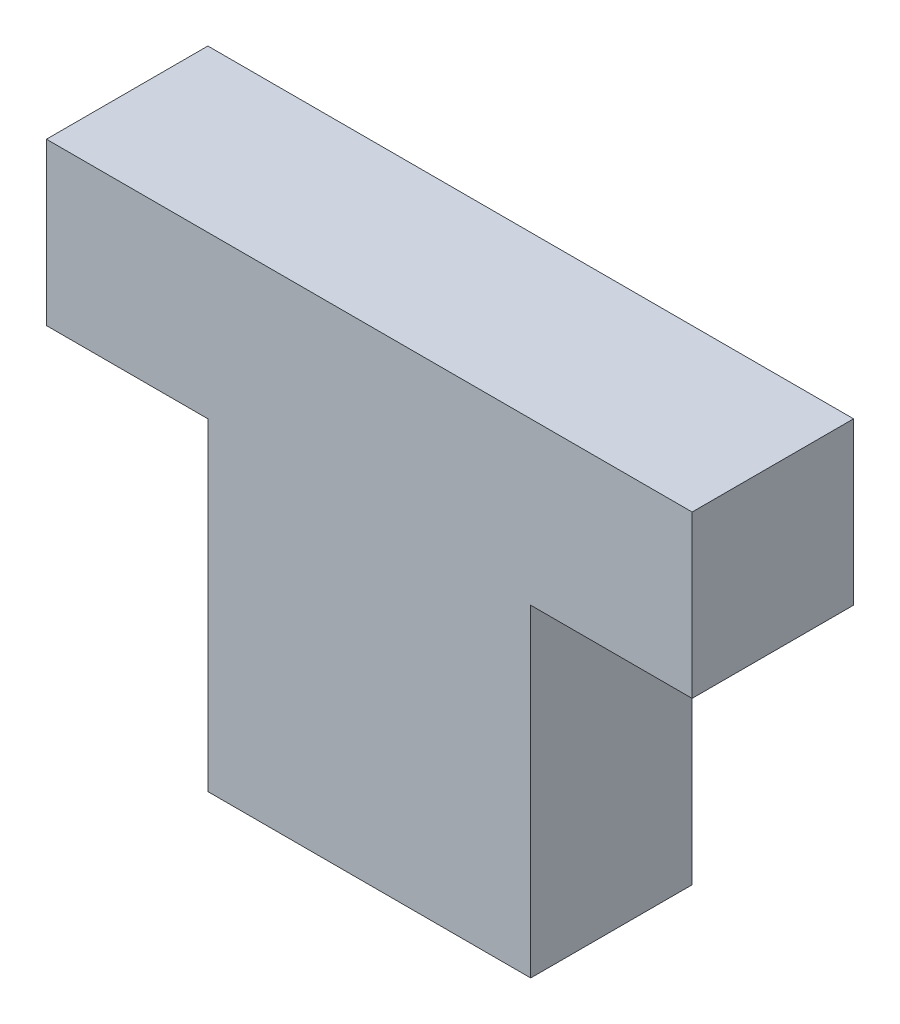
ISO-10303-21;
HEADER;
FILE_DESCRIPTION(('STEP AP214'),'2;1');
FILE_NAME('part.step','',(''),(''),'','','');
FILE_SCHEMA(('AUTOMOTIVE_DESIGN { 1 0 10303 214 1 1 1 1 }'));
ENDSEC;
DATA;
#1=APPLICATION_CONTEXT('core data for automotive mechanical design processes');
#2=APPLICATION_PROTOCOL_DEFINITION('international standard','automotive_design',2000,#1);
#3=PRODUCT_CONTEXT('',#1,'mechanical');
#4=PRODUCT('Part','Part','',(#3));
#5=PRODUCT_RELATED_PRODUCT_CATEGORY('part','',(#4));
#6=PRODUCT_DEFINITION_FORMATION('','',#4);
#7=PRODUCT_DEFINITION_CONTEXT('part definition',#1,'design');
#8=PRODUCT_DEFINITION('design','',#6,#7);
#9=PRODUCT_DEFINITION_SHAPE('','',#8);
#10=(LENGTH_UNIT() NAMED_UNIT(*) SI_UNIT(.MILLI.,.METRE.));
#11=(NAMED_UNIT(*) PLANE_ANGLE_UNIT() SI_UNIT($,.RADIAN.));
#12=(NAMED_UNIT(*) SI_UNIT($,.STERADIAN.) SOLID_ANGLE_UNIT());
#13=UNCERTAINTY_MEASURE_WITH_UNIT(LENGTH_MEASURE(1.E-05),#10,'distance_accuracy_value','');
#14=(GEOMETRIC_REPRESENTATION_CONTEXT(3) GLOBAL_UNCERTAINTY_ASSIGNED_CONTEXT((#13)) GLOBAL_UNIT_ASSIGNED_CONTEXT((#10,
#11,#12)) REPRESENTATION_CONTEXT('',''));
#15=CARTESIAN_POINT('',(0.,0.,0.));
#16=DIRECTION('',(0.,0.,1.));
#17=DIRECTION('',(1.,0.,0.));
#18=AXIS2_PLACEMENT_3D('',#15,#16,#17);
#19=CARTESIAN_POINT('',(4.99999999999999,0.,5.));
#20=DIRECTION('',(-1.,0.,0.));
#21=DIRECTION('',(0.,-1.,0.));
#22=AXIS2_PLACEMENT_3D('',#19,#20,#21);
#23=PLANE('',#22);
#24=DIRECTION('',(0.,1.,0.));
#25=VECTOR('',#24,1.);
#26=CARTESIAN_POINT('',(4.99999999999999,0.,0.));
#27=LINE('',#26,#25);
#28=CARTESIAN_POINT('',(5.,10.,0.));
#29=VERTEX_POINT('',#28);
#30=CARTESIAN_POINT('',(5.,15.,0.));
#31=VERTEX_POINT('',#30);
#32=EDGE_CURVE('E132',#29,#31,#27,.T.);
#33=ORIENTED_EDGE('',*,*,#32,.T.);
#34=DIRECTION('',(0.,0.,-1.));
#35=VECTOR('',#34,1.);
#36=CARTESIAN_POINT('',(5.,15.,5.));
#37=LINE('',#36,#35);
#38=CARTESIAN_POINT('',(5.,15.,5.));
#39=VERTEX_POINT('',#38);
#40=EDGE_CURVE('E11',#39,#31,#37,.T.);
#41=ORIENTED_EDGE('',*,*,#40,.F.);
#42=DIRECTION('',(0.,1.,0.));
#43=VECTOR('',#42,1.);
#44=CARTESIAN_POINT('',(4.99999999999999,0.,5.));
#45=LINE('',#44,#43);
#46=CARTESIAN_POINT('',(5.,10.,5.));
#47=VERTEX_POINT('',#46);
#48=EDGE_CURVE('E172',#47,#39,#45,.T.);
#49=ORIENTED_EDGE('',*,*,#48,.F.);
#50=DIRECTION('',(0.,0.,-1.));
#51=VECTOR('',#50,1.);
#52=CARTESIAN_POINT('',(5.,10.,5.));
#53=LINE('',#52,#51);
#54=EDGE_CURVE('E50',#47,#29,#53,.T.);
#55=ORIENTED_EDGE('',*,*,#54,.T.);
#56=EDGE_LOOP('',(#33,#41,#49,#55));
#57=FACE_BOUND('',#56,.T.);
#58=ADVANCED_FACE('F34',(#57),#23,.F.);
#59=CARTESIAN_POINT('',(0.,15.,5.));
#60=DIRECTION('',(0.,-1.,0.));
#61=DIRECTION('',(1.,0.,0.));
#62=AXIS2_PLACEMENT_3D('',#59,#60,#61);
#63=PLANE('',#62);
#64=DIRECTION('',(-1.,0.,0.));
#65=VECTOR('',#64,1.);
#66=CARTESIAN_POINT('',(0.,15.,0.));
#67=LINE('',#66,#65);
#68=CARTESIAN_POINT('',(-15.,15.,0.));
#69=VERTEX_POINT('',#68);
#70=EDGE_CURVE('E134',#31,#69,#67,.T.);
#71=ORIENTED_EDGE('',*,*,#70,.T.);
#72=DIRECTION('',(0.,0.,-1.));
#73=VECTOR('',#72,1.);
#74=CARTESIAN_POINT('',(-15.,15.,5.));
#75=LINE('',#74,#73);
#76=CARTESIAN_POINT('',(-15.,15.,5.));
#77=VERTEX_POINT('',#76);
#78=EDGE_CURVE('E42',#77,#69,#75,.T.);
#79=ORIENTED_EDGE('',*,*,#78,.F.);
#80=DIRECTION('',(-1.,0.,0.));
#81=VECTOR('',#80,1.);
#82=CARTESIAN_POINT('',(0.,15.,5.));
#83=LINE('',#82,#81);
#84=EDGE_CURVE('E89',#39,#77,#83,.T.);
#85=ORIENTED_EDGE('',*,*,#84,.F.);
#86=ORIENTED_EDGE('',*,*,#40,.T.);
#87=EDGE_LOOP('',(#71,#79,#85,#86));
#88=FACE_BOUND('',#87,.T.);
#89=ADVANCED_FACE('F162',(#88),#63,.F.);
#90=CARTESIAN_POINT('',(-15.,0.,5.));
#91=DIRECTION('',(-1.,0.,0.));
#92=DIRECTION('',(0.,0.,1.));
#93=AXIS2_PLACEMENT_3D('',#90,#91,#92);
#94=PLANE('',#93);
#95=DIRECTION('',(0.,1.,0.));
#96=VECTOR('',#95,1.);
#97=CARTESIAN_POINT('',(-15.,0.,0.));
#98=LINE('',#97,#96);
#99=CARTESIAN_POINT('',(-15.,10.,0.));
#100=VERTEX_POINT('',#99);
#101=EDGE_CURVE('E137',#100,#69,#98,.T.);
#102=ORIENTED_EDGE('',*,*,#101,.F.);
#103=DIRECTION('',(0.,0.,-1.));
#104=VECTOR('',#103,1.);
#105=CARTESIAN_POINT('',(-15.,10.,5.));
#106=LINE('',#105,#104);
#107=CARTESIAN_POINT('',(-15.,10.,5.));
#108=VERTEX_POINT('',#107);
#109=EDGE_CURVE('E155',#108,#100,#106,.T.);
#110=ORIENTED_EDGE('',*,*,#109,.F.);
#111=DIRECTION('',(0.,1.,0.));
#112=VECTOR('',#111,1.);
#113=CARTESIAN_POINT('',(-15.,0.,5.));
#114=LINE('',#113,#112);
#115=EDGE_CURVE('E161',#108,#77,#114,.T.);
#116=ORIENTED_EDGE('',*,*,#115,.T.);
#117=ORIENTED_EDGE('',*,*,#78,.T.);
#118=EDGE_LOOP('',(#102,#110,#116,#117));
#119=FACE_BOUND('',#118,.T.);
#120=ADVANCED_FACE('F159',(#119),#94,.T.);
#121=CARTESIAN_POINT('',(0.,10.,5.));
#122=DIRECTION('',(0.,-1.,0.));
#123=DIRECTION('',(0.,0.,-1.));
#124=AXIS2_PLACEMENT_3D('',#121,#122,#123);
#125=PLANE('',#124);
#126=DIRECTION('',(-1.,0.,0.));
#127=VECTOR('',#126,1.);
#128=CARTESIAN_POINT('',(0.,10.,0.));
#129=LINE('',#128,#127);
#130=CARTESIAN_POINT('',(-10.,10.,0.));
#131=VERTEX_POINT('',#130);
#132=EDGE_CURVE('E140',#131,#100,#129,.T.);
#133=ORIENTED_EDGE('',*,*,#132,.F.);
#134=DIRECTION('',(0.,0.,-1.));
#135=VECTOR('',#134,1.);
#136=CARTESIAN_POINT('',(-10.,10.,5.));
#137=LINE('',#136,#135);
#138=CARTESIAN_POINT('',(-10.,10.,5.));
#139=VERTEX_POINT('',#138);
#140=EDGE_CURVE('E153',#139,#131,#137,.T.);
#141=ORIENTED_EDGE('',*,*,#140,.F.);
#142=DIRECTION('',(-1.,0.,0.));
#143=VECTOR('',#142,1.);
#144=CARTESIAN_POINT('',(0.,10.,5.));
#145=LINE('',#144,#143);
#146=EDGE_CURVE('E128',#139,#108,#145,.T.);
#147=ORIENTED_EDGE('',*,*,#146,.T.);
#148=ORIENTED_EDGE('',*,*,#109,.T.);
#149=EDGE_LOOP('',(#133,#141,#147,#148));
#150=FACE_BOUND('',#149,.T.);
#151=ADVANCED_FACE('F169',(#150),#125,.T.);
#152=CARTESIAN_POINT('',(-10.,0.,5.));
#153=DIRECTION('',(-1.,0.,0.));
#154=DIRECTION('',(0.,-1.,0.));
#155=AXIS2_PLACEMENT_3D('',#152,#153,#154);
#156=PLANE('',#155);
#157=DIRECTION('',(0.,1.,0.));
#158=VECTOR('',#157,1.);
#159=CARTESIAN_POINT('',(-10.,0.,0.));
#160=LINE('',#159,#158);
#161=CARTESIAN_POINT('',(-10.,0.,0.));
#162=VERTEX_POINT('',#161);
#163=EDGE_CURVE('E143',#162,#131,#160,.T.);
#164=ORIENTED_EDGE('',*,*,#163,.F.);
#165=DIRECTION('',(0.,0.,-1.));
#166=VECTOR('',#165,1.);
#167=CARTESIAN_POINT('',(-10.,0.,5.));
#168=LINE('',#167,#166);
#169=CARTESIAN_POINT('',(-10.,0.,5.));
#170=VERTEX_POINT('',#169);
#171=EDGE_CURVE('E114',#170,#162,#168,.T.);
#172=ORIENTED_EDGE('',*,*,#171,.F.);
#173=DIRECTION('',(0.,1.,0.));
#174=VECTOR('',#173,1.);
#175=CARTESIAN_POINT('',(-10.,0.,5.));
#176=LINE('',#175,#174);
#177=EDGE_CURVE('E126',#170,#139,#176,.T.);
#178=ORIENTED_EDGE('',*,*,#177,.T.);
#179=ORIENTED_EDGE('',*,*,#140,.T.);
#180=EDGE_LOOP('',(#164,#172,#178,#179));
#181=FACE_BOUND('',#180,.T.);
#182=ADVANCED_FACE('F187',(#181),#156,.T.);
#183=CARTESIAN_POINT('',(0.,0.,5.));
#184=DIRECTION('',(0.,-1.,0.));
#185=DIRECTION('',(1.,0.,0.));
#186=AXIS2_PLACEMENT_3D('',#183,#184,#185);
#187=PLANE('',#186);
#188=DIRECTION('',(-1.,0.,0.));
#189=VECTOR('',#188,1.);
#190=CARTESIAN_POINT('',(0.,0.,0.));
#191=LINE('',#190,#189);
#192=CARTESIAN_POINT('',(0.,0.,0.));
#193=VERTEX_POINT('',#192);
#194=EDGE_CURVE('E111',#193,#162,#191,.T.);
#195=ORIENTED_EDGE('',*,*,#194,.F.);
#196=DIRECTION('',(0.,0.,-1.));
#197=VECTOR('',#196,1.);
#198=CARTESIAN_POINT('',(0.,0.,5.));
#199=LINE('',#198,#197);
#200=CARTESIAN_POINT('',(0.,0.,5.));
#201=VERTEX_POINT('',#200);
#202=EDGE_CURVE('E105',#201,#193,#199,.T.);
#203=ORIENTED_EDGE('',*,*,#202,.F.);
#204=DIRECTION('',(-1.,0.,0.));
#205=VECTOR('',#204,1.);
#206=CARTESIAN_POINT('',(0.,0.,5.));
#207=LINE('',#206,#205);
#208=EDGE_CURVE('E109',#201,#170,#207,.T.);
#209=ORIENTED_EDGE('',*,*,#208,.T.);
#210=ORIENTED_EDGE('',*,*,#171,.T.);
#211=EDGE_LOOP('',(#195,#203,#209,#210));
#212=FACE_BOUND('',#211,.T.);
#213=ADVANCED_FACE('F107',(#212),#187,.T.);
#214=CARTESIAN_POINT('',(0.,0.,5.));
#215=DIRECTION('',(-1.,0.,0.));
#216=DIRECTION('',(0.,-1.,0.));
#217=AXIS2_PLACEMENT_3D('',#214,#215,#216);
#218=PLANE('',#217);
#219=DIRECTION('',(0.,1.,0.));
#220=VECTOR('',#219,1.);
#221=CARTESIAN_POINT('',(0.,0.,0.));
#222=LINE('',#221,#220);
#223=CARTESIAN_POINT('',(0.,10.,0.));
#224=VERTEX_POINT('',#223);
#225=EDGE_CURVE('E148',#193,#224,#222,.T.);
#226=ORIENTED_EDGE('',*,*,#225,.T.);
#227=DIRECTION('',(0.,0.,-1.));
#228=VECTOR('',#227,1.);
#229=CARTESIAN_POINT('',(0.,10.,5.));
#230=LINE('',#229,#228);
#231=CARTESIAN_POINT('',(0.,10.,5.));
#232=VERTEX_POINT('',#231);
#233=EDGE_CURVE('E77',#232,#224,#230,.T.);
#234=ORIENTED_EDGE('',*,*,#233,.F.);
#235=DIRECTION('',(0.,1.,0.));
#236=VECTOR('',#235,1.);
#237=CARTESIAN_POINT('',(0.,0.,5.));
#238=LINE('',#237,#236);
#239=EDGE_CURVE('E116',#201,#232,#238,.T.);
#240=ORIENTED_EDGE('',*,*,#239,.F.);
#241=ORIENTED_EDGE('',*,*,#202,.T.);
#242=EDGE_LOOP('',(#226,#234,#240,#241));
#243=FACE_BOUND('',#242,.T.);
#244=ADVANCED_FACE('F117',(#243),#218,.F.);
#245=EDGE_CURVE('E144',#29,#224,#129,.T.);
#246=ORIENTED_EDGE('',*,*,#245,.F.);
#247=ORIENTED_EDGE('',*,*,#54,.F.);
#248=EDGE_CURVE('E120',#47,#232,#145,.T.);
#249=ORIENTED_EDGE('',*,*,#248,.T.);
#250=ORIENTED_EDGE('',*,*,#233,.T.);
#251=EDGE_LOOP('',(#246,#247,#249,#250));
#252=FACE_BOUND('',#251,.T.);
#253=ADVANCED_FACE('F176',(#252),#125,.T.);
#254=CARTESIAN_POINT('',(0.,0.,5.));
#255=DIRECTION('',(0.,0.,1.));
#256=DIRECTION('',(1.,0.,0.));
#257=AXIS2_PLACEMENT_3D('',#254,#255,#256);
#258=PLANE('',#257);
#259=ORIENTED_EDGE('',*,*,#48,.T.);
#260=ORIENTED_EDGE('',*,*,#84,.T.);
#261=ORIENTED_EDGE('',*,*,#115,.F.);
#262=ORIENTED_EDGE('',*,*,#146,.F.);
#263=ORIENTED_EDGE('',*,*,#177,.F.);
#264=ORIENTED_EDGE('',*,*,#208,.F.);
#265=ORIENTED_EDGE('',*,*,#239,.T.);
#266=ORIENTED_EDGE('',*,*,#248,.F.);
#267=EDGE_LOOP('',(#259,#260,#261,#262,#263,#264,#265,#266));
#268=FACE_BOUND('',#267,.T.);
#269=ADVANCED_FACE('F123',(#268),#258,.T.);
#270=CARTESIAN_POINT('',(0.,0.,0.));
#271=DIRECTION('',(0.,0.,1.));
#272=DIRECTION('',(1.,0.,0.));
#273=AXIS2_PLACEMENT_3D('',#270,#271,#272);
#274=PLANE('',#273);
#275=ORIENTED_EDGE('',*,*,#32,.F.);
#276=ORIENTED_EDGE('',*,*,#245,.T.);
#277=ORIENTED_EDGE('',*,*,#225,.F.);
#278=ORIENTED_EDGE('',*,*,#194,.T.);
#279=ORIENTED_EDGE('',*,*,#163,.T.);
#280=ORIENTED_EDGE('',*,*,#132,.T.);
#281=ORIENTED_EDGE('',*,*,#101,.T.);
#282=ORIENTED_EDGE('',*,*,#70,.F.);
#283=EDGE_LOOP('',(#275,#276,#277,#278,#279,#280,#281,#282));
#284=FACE_BOUND('',#283,.T.);
#285=ADVANCED_FACE('F165',(#284),#274,.F.);
#286=CLOSED_SHELL('',(#58,#89,#120,#151,#182,#213,#244,#253,#269,#285));
#287=MANIFOLD_SOLID_BREP('B2',#286);
#288=ADVANCED_BREP_SHAPE_REPRESENTATION('',(#18,#287),#14);
#289=SHAPE_DEFINITION_REPRESENTATION(#9,#288);
ENDSEC;
END-ISO-10303-21;
